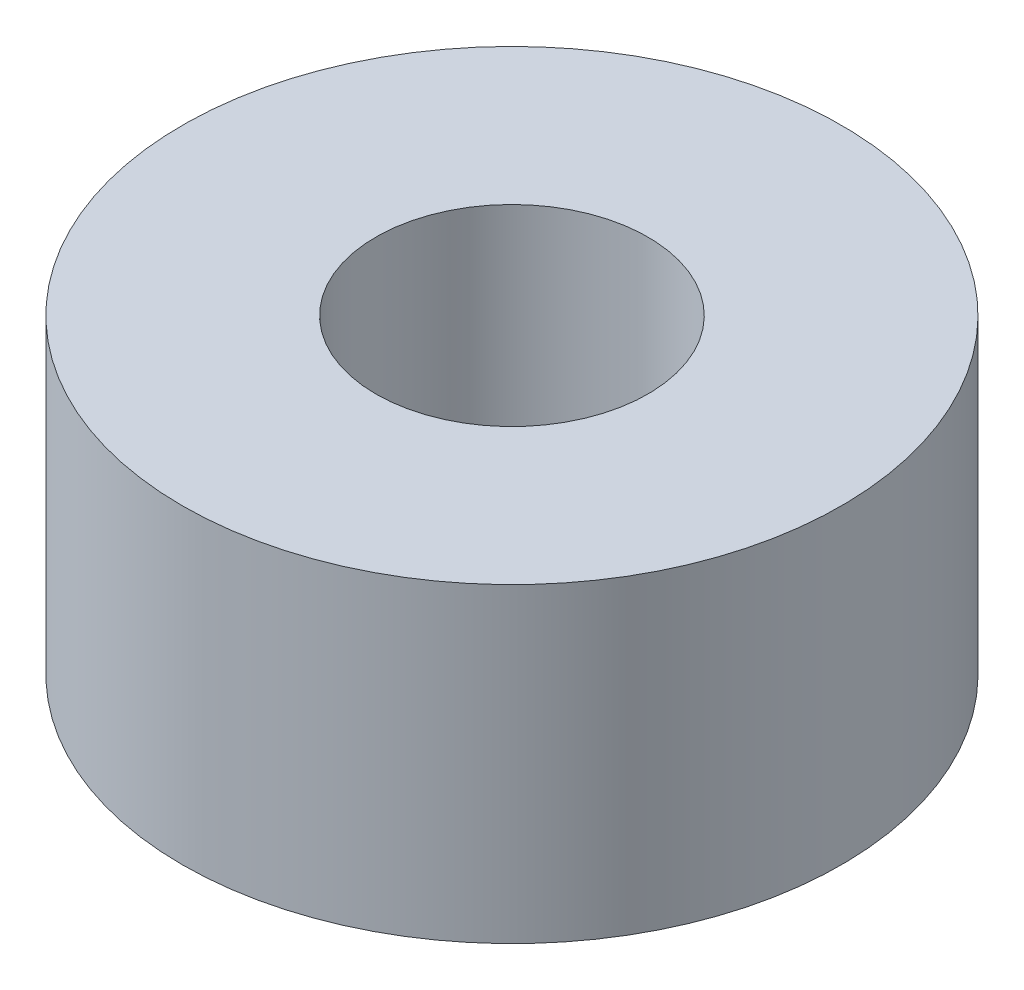
ISO-10303-21;
HEADER;
FILE_DESCRIPTION(('STEP AP214'),'2;1');
FILE_NAME('part.step','',(''),(''),'','','');
FILE_SCHEMA(('AUTOMOTIVE_DESIGN { 1 0 10303 214 1 1 1 1 }'));
ENDSEC;
DATA;
#1=APPLICATION_CONTEXT('core data for automotive mechanical design processes');
#2=APPLICATION_PROTOCOL_DEFINITION('international standard','automotive_design',2000,#1);
#3=PRODUCT_CONTEXT('',#1,'mechanical');
#4=PRODUCT('Part','Part','',(#3));
#5=PRODUCT_RELATED_PRODUCT_CATEGORY('part','',(#4));
#6=PRODUCT_DEFINITION_FORMATION('','',#4);
#7=PRODUCT_DEFINITION_CONTEXT('part definition',#1,'design');
#8=PRODUCT_DEFINITION('design','',#6,#7);
#9=PRODUCT_DEFINITION_SHAPE('','',#8);
#10=(LENGTH_UNIT() NAMED_UNIT(*) SI_UNIT(.MILLI.,.METRE.));
#11=(NAMED_UNIT(*) PLANE_ANGLE_UNIT() SI_UNIT($,.RADIAN.));
#12=(NAMED_UNIT(*) SI_UNIT($,.STERADIAN.) SOLID_ANGLE_UNIT());
#13=UNCERTAINTY_MEASURE_WITH_UNIT(LENGTH_MEASURE(1.E-05),#10,'distance_accuracy_value','');
#14=(GEOMETRIC_REPRESENTATION_CONTEXT(3) GLOBAL_UNCERTAINTY_ASSIGNED_CONTEXT((#13)) GLOBAL_UNIT_ASSIGNED_CONTEXT((#10,
#11,#12)) REPRESENTATION_CONTEXT('',''));
#15=CARTESIAN_POINT('',(0.,0.,0.));
#16=DIRECTION('',(0.,0.,1.));
#17=DIRECTION('',(1.,0.,0.));
#18=AXIS2_PLACEMENT_3D('',#15,#16,#17);
#19=CARTESIAN_POINT('',(0.,12.7,0.));
#20=DIRECTION('',(0.,1.,0.));
#21=DIRECTION('',(0.,0.,1.));
#22=AXIS2_PLACEMENT_3D('',#19,#20,#21);
#23=PLANE('',#22);
#24=CARTESIAN_POINT('',(0.,12.7,0.));
#25=DIRECTION('',(0.,1.,0.));
#26=DIRECTION('',(0.,0.,1.));
#27=AXIS2_PLACEMENT_3D('',#24,#25,#26);
#28=CIRCLE('',#27,13.462);
#29=CARTESIAN_POINT('',(0.,12.7,13.462));
#30=VERTEX_POINT('',#29);
#31=EDGE_CURVE('E10',#30,#30,#28,.T.);
#32=ORIENTED_EDGE('',*,*,#31,.T.);
#33=EDGE_LOOP('',(#32));
#34=FACE_BOUND('',#33,.T.);
#35=CARTESIAN_POINT('',(0.,12.7,0.));
#36=DIRECTION('',(0.,1.,0.));
#37=DIRECTION('',(0.,0.,1.));
#38=AXIS2_PLACEMENT_3D('',#35,#36,#37);
#39=CIRCLE('',#38,5.55625);
#40=CARTESIAN_POINT('',(0.,12.7,5.55625));
#41=VERTEX_POINT('',#40);
#42=EDGE_CURVE('E42',#41,#41,#39,.T.);
#43=ORIENTED_EDGE('',*,*,#42,.F.);
#44=EDGE_LOOP('',(#43));
#45=FACE_BOUND('',#44,.T.);
#46=ADVANCED_FACE('F31',(#34,#45),#23,.T.);
#47=CARTESIAN_POINT('',(0.,0.,0.));
#48=DIRECTION('',(0.,1.,0.));
#49=DIRECTION('',(0.,0.,1.));
#50=AXIS2_PLACEMENT_3D('',#47,#48,#49);
#51=PLANE('',#50);
#52=CARTESIAN_POINT('',(0.,0.,0.));
#53=DIRECTION('',(0.,1.,0.));
#54=DIRECTION('',(0.,0.,1.));
#55=AXIS2_PLACEMENT_3D('',#52,#53,#54);
#56=CIRCLE('',#55,13.462);
#57=CARTESIAN_POINT('',(0.,0.,13.462));
#58=VERTEX_POINT('',#57);
#59=EDGE_CURVE('E35',#58,#58,#56,.T.);
#60=ORIENTED_EDGE('',*,*,#59,.F.);
#61=EDGE_LOOP('',(#60));
#62=FACE_BOUND('',#61,.T.);
#63=CARTESIAN_POINT('',(0.,0.,0.));
#64=DIRECTION('',(0.,1.,0.));
#65=DIRECTION('',(0.,0.,1.));
#66=AXIS2_PLACEMENT_3D('',#63,#64,#65);
#67=CIRCLE('',#66,5.55625);
#68=CARTESIAN_POINT('',(0.,0.,5.55625));
#69=VERTEX_POINT('',#68);
#70=EDGE_CURVE('E44',#69,#69,#67,.T.);
#71=ORIENTED_EDGE('',*,*,#70,.T.);
#72=EDGE_LOOP('',(#71));
#73=FACE_BOUND('',#72,.T.);
#74=ADVANCED_FACE('F54',(#62,#73),#51,.F.);
#75=CARTESIAN_POINT('',(0.,12.7,0.));
#76=DIRECTION('',(0.,-1.,0.));
#77=DIRECTION('',(0.,0.,-1.));
#78=AXIS2_PLACEMENT_3D('',#75,#76,#77);
#79=CYLINDRICAL_SURFACE('',#78,13.462);
#80=ORIENTED_EDGE('',*,*,#31,.F.);
#81=EDGE_LOOP('',(#80));
#82=FACE_BOUND('',#81,.T.);
#83=ORIENTED_EDGE('',*,*,#59,.T.);
#84=EDGE_LOOP('',(#83));
#85=FACE_BOUND('',#84,.T.);
#86=ADVANCED_FACE('F33',(#82,#85),#79,.T.);
#87=CARTESIAN_POINT('',(0.,12.7,0.));
#88=DIRECTION('',(0.,-1.,0.));
#89=DIRECTION('',(0.,0.,-1.));
#90=AXIS2_PLACEMENT_3D('',#87,#88,#89);
#91=CYLINDRICAL_SURFACE('',#90,5.55625);
#92=ORIENTED_EDGE('',*,*,#42,.T.);
#93=EDGE_LOOP('',(#92));
#94=FACE_BOUND('',#93,.T.);
#95=ORIENTED_EDGE('',*,*,#70,.F.);
#96=EDGE_LOOP('',(#95));
#97=FACE_BOUND('',#96,.T.);
#98=ADVANCED_FACE('F50',(#94,#97),#91,.F.);
#99=CLOSED_SHELL('',(#46,#74,#86,#98));
#100=MANIFOLD_SOLID_BREP('B2',#99);
#101=ADVANCED_BREP_SHAPE_REPRESENTATION('',(#18,#100),#14);
#102=SHAPE_DEFINITION_REPRESENTATION(#9,#101);
ENDSEC;
END-ISO-10303-21;
